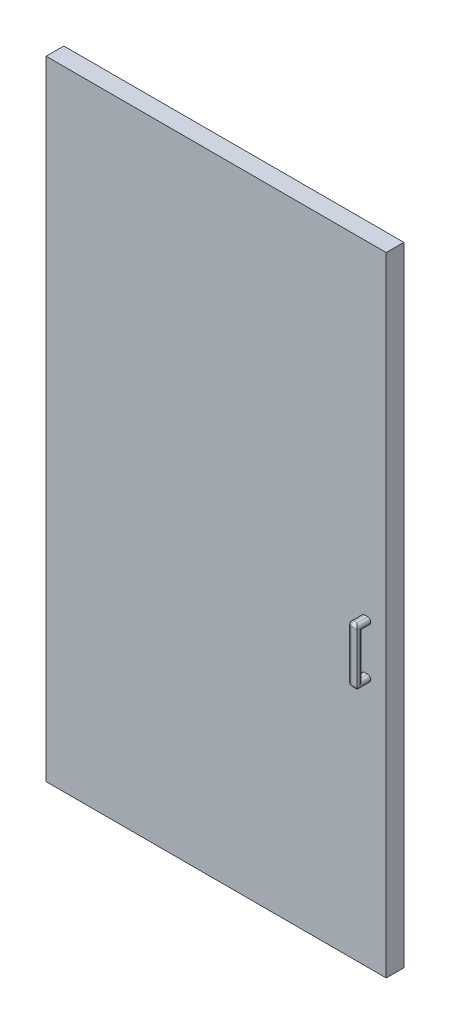
ISO-10303-21;
HEADER;
FILE_DESCRIPTION(('STEP AP214'),'2;1');
FILE_NAME('part.step','',(''),(''),'','','');
FILE_SCHEMA(('AUTOMOTIVE_DESIGN { 1 0 10303 214 1 1 1 1 }'));
ENDSEC;
DATA;
#1=APPLICATION_CONTEXT('core data for automotive mechanical design processes');
#2=APPLICATION_PROTOCOL_DEFINITION('international standard','automotive_design',2000,#1);
#3=PRODUCT_CONTEXT('',#1,'mechanical');
#4=PRODUCT('Part','Part','',(#3));
#5=PRODUCT_RELATED_PRODUCT_CATEGORY('part','',(#4));
#6=PRODUCT_DEFINITION_FORMATION('','',#4);
#7=PRODUCT_DEFINITION_CONTEXT('part definition',#1,'design');
#8=PRODUCT_DEFINITION('design','',#6,#7);
#9=PRODUCT_DEFINITION_SHAPE('','',#8);
#10=(LENGTH_UNIT() NAMED_UNIT(*) SI_UNIT(.MILLI.,.METRE.));
#11=(NAMED_UNIT(*) PLANE_ANGLE_UNIT() SI_UNIT($,.RADIAN.));
#12=(NAMED_UNIT(*) SI_UNIT($,.STERADIAN.) SOLID_ANGLE_UNIT());
#13=UNCERTAINTY_MEASURE_WITH_UNIT(LENGTH_MEASURE(1.E-05),#10,'distance_accuracy_value','');
#14=(GEOMETRIC_REPRESENTATION_CONTEXT(3) GLOBAL_UNCERTAINTY_ASSIGNED_CONTEXT((#13)) GLOBAL_UNIT_ASSIGNED_CONTEXT((#10,
#11,#12)) REPRESENTATION_CONTEXT('',''));
#15=CARTESIAN_POINT('',(0.,0.,0.));
#16=DIRECTION('',(0.,0.,1.));
#17=DIRECTION('',(1.,0.,0.));
#18=AXIS2_PLACEMENT_3D('',#15,#16,#17);
#19=CARTESIAN_POINT('',(0.,0.,0.));
#20=DIRECTION('',(0.,0.,1.));
#21=DIRECTION('',(1.,0.,0.));
#22=AXIS2_PLACEMENT_3D('',#19,#20,#21);
#23=PLANE('',#22);
#24=DIRECTION('',(-1.,0.,0.));
#25=VECTOR('',#24,1.);
#26=CARTESIAN_POINT('',(0.,446.201837212028,0.));
#27=LINE('',#26,#25);
#28=CARTESIAN_POINT('',(0.,446.201837212028,0.));
#29=VERTEX_POINT('',#28);
#30=CARTESIAN_POINT('',(-1100.,446.201837212028,0.));
#31=VERTEX_POINT('',#30);
#32=EDGE_CURVE('E257',#29,#31,#27,.T.);
#33=ORIENTED_EDGE('',*,*,#32,.F.);
#34=DIRECTION('',(0.,1.,0.));
#35=VECTOR('',#34,1.);
#36=CARTESIAN_POINT('',(0.,0.,0.));
#37=LINE('',#36,#35);
#38=CARTESIAN_POINT('',(0.,-1585.79816278797,0.));
#39=VERTEX_POINT('',#38);
#40=EDGE_CURVE('E275',#39,#29,#37,.T.);
#41=ORIENTED_EDGE('',*,*,#40,.F.);
#42=DIRECTION('',(1.,0.,0.));
#43=VECTOR('',#42,1.);
#44=CARTESIAN_POINT('',(-1100.,-1585.79816278797,0.));
#45=LINE('',#44,#43);
#46=CARTESIAN_POINT('',(-1100.,-1585.79816278797,0.));
#47=VERTEX_POINT('',#46);
#48=EDGE_CURVE('E286',#47,#39,#45,.T.);
#49=ORIENTED_EDGE('',*,*,#48,.F.);
#50=DIRECTION('',(0.,-1.,0.));
#51=VECTOR('',#50,1.);
#52=CARTESIAN_POINT('',(-1100.,446.201837212028,0.));
#53=LINE('',#52,#51);
#54=EDGE_CURVE('E284',#31,#47,#53,.T.);
#55=ORIENTED_EDGE('',*,*,#54,.F.);
#56=EDGE_LOOP('',(#33,#41,#49,#55));
#57=FACE_BOUND('',#56,.T.);
#58=DIRECTION('',(0.,-1.,0.));
#59=VECTOR('',#58,1.);
#60=CARTESIAN_POINT('',(-34.9999999999999,-272.048700510207,0.));
#61=LINE('',#60,#59);
#62=CARTESIAN_POINT('',(-34.9999999999999,-272.048700510207,0.));
#63=VERTEX_POINT('',#62);
#64=CARTESIAN_POINT('',(-35.,-812.048700510207,0.));
#65=VERTEX_POINT('',#64);
#66=EDGE_CURVE('E233',#63,#65,#61,.T.);
#67=ORIENTED_EDGE('',*,*,#66,.F.);
#68=DIRECTION('',(1.,0.,0.));
#69=VECTOR('',#68,1.);
#70=CARTESIAN_POINT('',(-34.9999999999999,-272.048700510207,0.));
#71=LINE('',#70,#69);
#72=CARTESIAN_POINT('',(-165.,-272.048700510207,0.));
#73=VERTEX_POINT('',#72);
#74=EDGE_CURVE('E230',#73,#63,#71,.T.);
#75=ORIENTED_EDGE('',*,*,#74,.F.);
#76=DIRECTION('',(0.,1.,0.));
#77=VECTOR('',#76,1.);
#78=CARTESIAN_POINT('',(-165.,-272.048700510207,0.));
#79=LINE('',#78,#77);
#80=CARTESIAN_POINT('',(-165.,-812.048700510207,0.));
#81=VERTEX_POINT('',#80);
#82=EDGE_CURVE('E61',#81,#73,#79,.T.);
#83=ORIENTED_EDGE('',*,*,#82,.F.);
#84=DIRECTION('',(-1.,0.,0.));
#85=VECTOR('',#84,1.);
#86=CARTESIAN_POINT('',(-35.,-812.048700510207,0.));
#87=LINE('',#86,#85);
#88=EDGE_CURVE('E56',#65,#81,#87,.T.);
#89=ORIENTED_EDGE('',*,*,#88,.F.);
#90=EDGE_LOOP('',(#67,#75,#83,#89));
#91=FACE_BOUND('',#90,.T.);
#92=ADVANCED_FACE('F39',(#57,#91),#23,.F.);
#93=CARTESIAN_POINT('',(-79.9999999999999,-603.798162787972,101.15));
#94=DIRECTION('',(1.,0.,0.));
#95=DIRECTION('',(0.,1.,0.));
#96=AXIS2_PLACEMENT_3D('',#93,#94,#95);
#97=PLANE('',#96);
#98=DIRECTION('',(0.,-1.,0.));
#99=VECTOR('',#98,1.);
#100=CARTESIAN_POINT('',(-79.9999999999999,-603.798162787972,57.15));
#101=LINE('',#100,#99);
#102=CARTESIAN_POINT('',(-79.9999999999999,-774.798162787972,57.15));
#103=VERTEX_POINT('',#102);
#104=CARTESIAN_POINT('',(-79.9999999999999,-775.798162787972,57.15));
#105=VERTEX_POINT('',#104);
#106=EDGE_CURVE('E265',#103,#105,#101,.T.);
#107=ORIENTED_EDGE('',*,*,#106,.T.);
#108=DIRECTION('',(0.,0.,-1.));
#109=VECTOR('',#108,1.);
#110=CARTESIAN_POINT('',(-79.9999999999999,-775.798162787972,101.15));
#111=LINE('',#110,#109);
#112=CARTESIAN_POINT('',(-79.9999999999999,-775.798162787972,91.15));
#113=VERTEX_POINT('',#112);
#114=EDGE_CURVE('E328',#105,#113,#111,.F.);
#115=ORIENTED_EDGE('',*,*,#114,.T.);
#116=DIRECTION('',(0.,-1.,0.));
#117=VECTOR('',#116,1.);
#118=CARTESIAN_POINT('',(-79.9999999999999,-603.798162787972,91.15));
#119=LINE('',#118,#117);
#120=CARTESIAN_POINT('',(-79.9999999999999,-774.798162787972,91.15));
#121=VERTEX_POINT('',#120);
#122=EDGE_CURVE('E324',#113,#121,#119,.F.);
#123=ORIENTED_EDGE('',*,*,#122,.T.);
#124=DIRECTION('',(0.,0.,-1.));
#125=VECTOR('',#124,1.);
#126=CARTESIAN_POINT('',(-79.9999999999999,-774.798162787972,57.15));
#127=LINE('',#126,#125);
#128=EDGE_CURVE('E326',#121,#103,#127,.T.);
#129=ORIENTED_EDGE('',*,*,#128,.T.);
#130=EDGE_LOOP('',(#107,#115,#123,#129));
#131=FACE_BOUND('',#130,.T.);
#132=ADVANCED_FACE('F497',(#131),#97,.F.);
#133=CARTESIAN_POINT('',(-49.9999999999999,-603.798162787972,101.15));
#134=DIRECTION('',(-1.,0.,0.));
#135=DIRECTION('',(0.,-1.,0.));
#136=AXIS2_PLACEMENT_3D('',#133,#134,#135);
#137=PLANE('',#136);
#138=DIRECTION('',(0.,1.,0.));
#139=VECTOR('',#138,1.);
#140=CARTESIAN_POINT('',(-49.9999999999999,-603.798162787972,57.15));
#141=LINE('',#140,#139);
#142=CARTESIAN_POINT('',(-49.9999999999999,-614.798162787972,57.15));
#143=VERTEX_POINT('',#142);
#144=CARTESIAN_POINT('',(-49.9999999999999,-613.798162787972,57.15));
#145=VERTEX_POINT('',#144);
#146=EDGE_CURVE('E243',#143,#145,#141,.T.);
#147=ORIENTED_EDGE('',*,*,#146,.T.);
#148=DIRECTION('',(0.,0.,-1.));
#149=VECTOR('',#148,1.);
#150=CARTESIAN_POINT('',(-49.9999999999999,-613.798162787972,101.15));
#151=LINE('',#150,#149);
#152=CARTESIAN_POINT('',(-49.9999999999999,-613.798162787972,101.15));
#153=VERTEX_POINT('',#152);
#154=EDGE_CURVE('E343',#145,#153,#151,.F.);
#155=ORIENTED_EDGE('',*,*,#154,.T.);
#156=DIRECTION('',(0.,1.,0.));
#157=VECTOR('',#156,1.);
#158=CARTESIAN_POINT('',(-49.9999999999999,-603.798162787972,101.15));
#159=LINE('',#158,#157);
#160=CARTESIAN_POINT('',(-49.9999999999999,-775.798162787972,101.15));
#161=VERTEX_POINT('',#160);
#162=EDGE_CURVE('E254',#161,#153,#159,.T.);
#163=ORIENTED_EDGE('',*,*,#162,.F.);
#164=DIRECTION('',(0.,0.,-1.));
#165=VECTOR('',#164,1.);
#166=CARTESIAN_POINT('',(-49.9999999999999,-775.798162787972,101.15));
#167=LINE('',#166,#165);
#168=CARTESIAN_POINT('',(-49.9999999999999,-775.798162787972,57.15));
#169=VERTEX_POINT('',#168);
#170=EDGE_CURVE('E335',#161,#169,#167,.T.);
#171=ORIENTED_EDGE('',*,*,#170,.T.);
#172=CARTESIAN_POINT('',(-49.9999999999999,-774.798162787972,57.15));
#173=VERTEX_POINT('',#172);
#174=EDGE_CURVE('E259',#169,#173,#141,.T.);
#175=ORIENTED_EDGE('',*,*,#174,.T.);
#176=DIRECTION('',(0.,0.,-1.));
#177=VECTOR('',#176,1.);
#178=CARTESIAN_POINT('',(-49.9999999999999,-774.798162787972,83.15));
#179=LINE('',#178,#177);
#180=CARTESIAN_POINT('',(-49.9999999999999,-774.798162787972,93.15));
#181=VERTEX_POINT('',#180);
#182=EDGE_CURVE('E337',#173,#181,#179,.F.);
#183=ORIENTED_EDGE('',*,*,#182,.T.);
#184=DIRECTION('',(0.,-1.,0.));
#185=VECTOR('',#184,1.);
#186=CARTESIAN_POINT('',(-49.9999999999999,-624.798162787972,93.15));
#187=LINE('',#186,#185);
#188=CARTESIAN_POINT('',(-49.9999999999999,-614.798162787972,93.15));
#189=VERTEX_POINT('',#188);
#190=EDGE_CURVE('E339',#181,#189,#187,.F.);
#191=ORIENTED_EDGE('',*,*,#190,.T.);
#192=DIRECTION('',(0.,0.,1.));
#193=VECTOR('',#192,1.);
#194=CARTESIAN_POINT('',(-49.9999999999999,-614.798162787972,57.15));
#195=LINE('',#194,#193);
#196=EDGE_CURVE('E341',#189,#143,#195,.F.);
#197=ORIENTED_EDGE('',*,*,#196,.T.);
#198=EDGE_LOOP('',(#147,#155,#163,#171,#175,#183,#191,#197));
#199=FACE_BOUND('',#198,.T.);
#200=ADVANCED_FACE('F417',(#199),#137,.F.);
#201=DIRECTION('',(0.,-1.,0.));
#202=VECTOR('',#201,1.);
#203=CARTESIAN_POINT('',(-79.9999999999999,-603.798162787972,91.15));
#204=LINE('',#203,#202);
#205=CARTESIAN_POINT('',(-79.9999999999999,-614.798162787972,91.15));
#206=VERTEX_POINT('',#205);
#207=CARTESIAN_POINT('',(-79.9999999999999,-613.798162787972,91.15));
#208=VERTEX_POINT('',#207);
#209=EDGE_CURVE('E318',#206,#208,#204,.F.);
#210=ORIENTED_EDGE('',*,*,#209,.T.);
#211=DIRECTION('',(0.,0.,-1.));
#212=VECTOR('',#211,1.);
#213=CARTESIAN_POINT('',(-79.9999999999999,-613.798162787972,101.15));
#214=LINE('',#213,#212);
#215=CARTESIAN_POINT('',(-79.9999999999999,-613.798162787972,57.15));
#216=VERTEX_POINT('',#215);
#217=EDGE_CURVE('E322',#208,#216,#214,.T.);
#218=ORIENTED_EDGE('',*,*,#217,.T.);
#219=CARTESIAN_POINT('',(-79.9999999999999,-614.798162787972,57.15));
#220=VERTEX_POINT('',#219);
#221=EDGE_CURVE('E266',#216,#220,#101,.T.);
#222=ORIENTED_EDGE('',*,*,#221,.T.);
#223=DIRECTION('',(0.,0.,1.));
#224=VECTOR('',#223,1.);
#225=CARTESIAN_POINT('',(-79.9999999999999,-614.798162787972,83.15));
#226=LINE('',#225,#224);
#227=EDGE_CURVE('E320',#220,#206,#226,.T.);
#228=ORIENTED_EDGE('',*,*,#227,.T.);
#229=EDGE_LOOP('',(#210,#218,#222,#228));
#230=FACE_BOUND('',#229,.T.);
#231=ADVANCED_FACE('F503',(#230),#97,.F.);
#232=CARTESIAN_POINT('',(0.,0.,57.15));
#233=DIRECTION('',(0.,0.,1.));
#234=DIRECTION('',(1.,0.,0.));
#235=AXIS2_PLACEMENT_3D('',#232,#233,#234);
#236=PLANE('',#235);
#237=DIRECTION('',(-1.,0.,0.));
#238=VECTOR('',#237,1.);
#239=CARTESIAN_POINT('',(-35.9999999999999,-764.798162787972,57.15));
#240=LINE('',#239,#238);
#241=CARTESIAN_POINT('',(-59.9999999999999,-764.798162787972,57.15));
#242=VERTEX_POINT('',#241);
#243=CARTESIAN_POINT('',(-69.9999999999999,-764.798162787972,57.15));
#244=VERTEX_POINT('',#243);
#245=EDGE_CURVE('E240',#242,#244,#240,.T.);
#246=ORIENTED_EDGE('',*,*,#245,.F.);
#247=CARTESIAN_POINT('',(-59.9999999999999,-774.798162787972,57.15));
#248=DIRECTION('',(0.,0.,1.));
#249=DIRECTION('',(1.,0.,0.));
#250=AXIS2_PLACEMENT_3D('',#247,#248,#249);
#251=CIRCLE('',#250,10.);
#252=EDGE_CURVE('E363',#242,#173,#251,.F.);
#253=ORIENTED_EDGE('',*,*,#252,.T.);
#254=ORIENTED_EDGE('',*,*,#174,.F.);
#255=CARTESIAN_POINT('',(-59.9999999999999,-775.798162787972,57.15));
#256=DIRECTION('',(0.,0.,1.));
#257=DIRECTION('',(1.,0.,0.));
#258=AXIS2_PLACEMENT_3D('',#255,#256,#257);
#259=CIRCLE('',#258,10.);
#260=CARTESIAN_POINT('',(-59.9999999999999,-785.798162787972,57.15));
#261=VERTEX_POINT('',#260);
#262=EDGE_CURVE('E365',#169,#261,#259,.F.);
#263=ORIENTED_EDGE('',*,*,#262,.T.);
#264=DIRECTION('',(1.,0.,0.));
#265=VECTOR('',#264,1.);
#266=CARTESIAN_POINT('',(-79.9999999999999,-785.798162787972,57.15));
#267=LINE('',#266,#265);
#268=CARTESIAN_POINT('',(-69.9999999999999,-785.798162787972,57.15));
#269=VERTEX_POINT('',#268);
#270=EDGE_CURVE('E258',#269,#261,#267,.T.);
#271=ORIENTED_EDGE('',*,*,#270,.F.);
#272=CARTESIAN_POINT('',(-69.9999999999999,-775.798162787972,57.15));
#273=DIRECTION('',(0.,0.,1.));
#274=DIRECTION('',(1.,0.,0.));
#275=AXIS2_PLACEMENT_3D('',#272,#273,#274);
#276=CIRCLE('',#275,10.);
#277=EDGE_CURVE('E48',#269,#105,#276,.F.);
#278=ORIENTED_EDGE('',*,*,#277,.T.);
#279=ORIENTED_EDGE('',*,*,#106,.F.);
#280=CARTESIAN_POINT('',(-69.9999999999999,-774.798162787972,57.15));
#281=DIRECTION('',(0.,0.,1.));
#282=DIRECTION('',(1.,0.,0.));
#283=AXIS2_PLACEMENT_3D('',#280,#281,#282);
#284=CIRCLE('',#283,10.);
#285=EDGE_CURVE('E11',#103,#244,#284,.F.);
#286=ORIENTED_EDGE('',*,*,#285,.T.);
#287=EDGE_LOOP('',(#246,#253,#254,#263,#271,#278,#279,#286));
#288=FACE_BOUND('',#287,.T.);
#289=ORIENTED_EDGE('',*,*,#146,.F.);
#290=CARTESIAN_POINT('',(-59.9999999999999,-614.798162787972,57.15));
#291=DIRECTION('',(0.,0.,1.));
#292=DIRECTION('',(1.,0.,0.));
#293=AXIS2_PLACEMENT_3D('',#290,#291,#292);
#294=CIRCLE('',#293,10.);
#295=CARTESIAN_POINT('',(-59.9999999999999,-624.798162787972,57.15));
#296=VERTEX_POINT('',#295);
#297=EDGE_CURVE('E361',#143,#296,#294,.F.);
#298=ORIENTED_EDGE('',*,*,#297,.T.);
#299=DIRECTION('',(-1.,0.,0.));
#300=VECTOR('',#299,1.);
#301=CARTESIAN_POINT('',(-35.9999999999999,-624.798162787972,57.15));
#302=LINE('',#301,#300);
#303=CARTESIAN_POINT('',(-69.9999999999999,-624.798162787972,57.15));
#304=VERTEX_POINT('',#303);
#305=EDGE_CURVE('E244',#296,#304,#302,.T.);
#306=ORIENTED_EDGE('',*,*,#305,.T.);
#307=CARTESIAN_POINT('',(-69.9999999999999,-614.798162787972,57.15));
#308=DIRECTION('',(0.,0.,1.));
#309=DIRECTION('',(1.,0.,0.));
#310=AXIS2_PLACEMENT_3D('',#307,#308,#309);
#311=CIRCLE('',#310,10.);
#312=EDGE_CURVE('E357',#304,#220,#311,.F.);
#313=ORIENTED_EDGE('',*,*,#312,.T.);
#314=ORIENTED_EDGE('',*,*,#221,.F.);
#315=CARTESIAN_POINT('',(-69.9999999999999,-613.798162787972,57.15));
#316=DIRECTION('',(0.,0.,1.));
#317=DIRECTION('',(1.,0.,0.));
#318=AXIS2_PLACEMENT_3D('',#315,#316,#317);
#319=CIRCLE('',#318,10.);
#320=CARTESIAN_POINT('',(-69.9999999999999,-603.798162787972,57.15));
#321=VERTEX_POINT('',#320);
#322=EDGE_CURVE('E355',#216,#321,#319,.F.);
#323=ORIENTED_EDGE('',*,*,#322,.T.);
#324=DIRECTION('',(-1.,0.,0.));
#325=VECTOR('',#324,1.);
#326=CARTESIAN_POINT('',(-79.9999999999999,-603.798162787972,57.15));
#327=LINE('',#326,#325);
#328=CARTESIAN_POINT('',(-59.9999999999999,-603.798162787972,57.15));
#329=VERTEX_POINT('',#328);
#330=EDGE_CURVE('E262',#329,#321,#327,.T.);
#331=ORIENTED_EDGE('',*,*,#330,.F.);
#332=CARTESIAN_POINT('',(-59.9999999999999,-613.798162787972,57.15));
#333=DIRECTION('',(0.,0.,1.));
#334=DIRECTION('',(1.,0.,0.));
#335=AXIS2_PLACEMENT_3D('',#332,#333,#334);
#336=CIRCLE('',#335,10.);
#337=EDGE_CURVE('E359',#329,#145,#336,.F.);
#338=ORIENTED_EDGE('',*,*,#337,.T.);
#339=EDGE_LOOP('',(#289,#298,#306,#313,#314,#323,#331,#338));
#340=FACE_BOUND('',#339,.T.);
#341=DIRECTION('',(-1.,0.,0.));
#342=VECTOR('',#341,1.);
#343=CARTESIAN_POINT('',(0.,446.201837212028,57.15));
#344=LINE('',#343,#342);
#345=CARTESIAN_POINT('',(0.,446.201837212028,57.15));
#346=VERTEX_POINT('',#345);
#347=CARTESIAN_POINT('',(-1100.,446.201837212028,57.15));
#348=VERTEX_POINT('',#347);
#349=EDGE_CURVE('E271',#346,#348,#344,.T.);
#350=ORIENTED_EDGE('',*,*,#349,.T.);
#351=DIRECTION('',(0.,-1.,0.));
#352=VECTOR('',#351,1.);
#353=CARTESIAN_POINT('',(-1100.,446.201837212028,57.15));
#354=LINE('',#353,#352);
#355=CARTESIAN_POINT('',(-1100.,-1585.79816278797,57.15));
#356=VERTEX_POINT('',#355);
#357=EDGE_CURVE('E274',#348,#356,#354,.T.);
#358=ORIENTED_EDGE('',*,*,#357,.T.);
#359=DIRECTION('',(1.,0.,0.));
#360=VECTOR('',#359,1.);
#361=CARTESIAN_POINT('',(-1100.,-1585.79816278797,57.15));
#362=LINE('',#361,#360);
#363=CARTESIAN_POINT('',(0.,-1585.79816278797,57.15));
#364=VERTEX_POINT('',#363);
#365=EDGE_CURVE('E277',#356,#364,#362,.T.);
#366=ORIENTED_EDGE('',*,*,#365,.T.);
#367=DIRECTION('',(0.,1.,0.));
#368=VECTOR('',#367,1.);
#369=CARTESIAN_POINT('',(0.,-1585.79816278797,57.15));
#370=LINE('',#369,#368);
#371=EDGE_CURVE('E279',#364,#346,#370,.T.);
#372=ORIENTED_EDGE('',*,*,#371,.T.);
#373=EDGE_LOOP('',(#350,#358,#366,#372));
#374=FACE_BOUND('',#373,.T.);
#375=ADVANCED_FACE('F421',(#288,#340,#374),#236,.T.);
#376=CARTESIAN_POINT('',(0.,446.201837212028,57.15));
#377=DIRECTION('',(0.,-1.,0.));
#378=DIRECTION('',(1.,0.,0.));
#379=AXIS2_PLACEMENT_3D('',#376,#377,#378);
#380=PLANE('',#379);
#381=ORIENTED_EDGE('',*,*,#32,.T.);
#382=DIRECTION('',(0.,0.,-1.));
#383=VECTOR('',#382,1.);
#384=CARTESIAN_POINT('',(-1100.,446.201837212028,57.15));
#385=LINE('',#384,#383);
#386=EDGE_CURVE('E298',#348,#31,#385,.T.);
#387=ORIENTED_EDGE('',*,*,#386,.F.);
#388=ORIENTED_EDGE('',*,*,#349,.F.);
#389=DIRECTION('',(0.,0.,-1.));
#390=VECTOR('',#389,1.);
#391=CARTESIAN_POINT('',(0.,446.201837212028,57.15));
#392=LINE('',#391,#390);
#393=EDGE_CURVE('E281',#346,#29,#392,.T.);
#394=ORIENTED_EDGE('',*,*,#393,.T.);
#395=EDGE_LOOP('',(#381,#387,#388,#394));
#396=FACE_BOUND('',#395,.T.);
#397=ADVANCED_FACE('F544',(#396),#380,.F.);
#398=CARTESIAN_POINT('',(-1100.,446.201837212028,57.15));
#399=DIRECTION('',(1.,0.,0.));
#400=DIRECTION('',(0.,0.,-1.));
#401=AXIS2_PLACEMENT_3D('',#398,#399,#400);
#402=PLANE('',#401);
#403=ORIENTED_EDGE('',*,*,#54,.T.);
#404=DIRECTION('',(0.,0.,-1.));
#405=VECTOR('',#404,1.);
#406=CARTESIAN_POINT('',(-1100.,-1585.79816278797,57.15));
#407=LINE('',#406,#405);
#408=EDGE_CURVE('E295',#356,#47,#407,.T.);
#409=ORIENTED_EDGE('',*,*,#408,.F.);
#410=ORIENTED_EDGE('',*,*,#357,.F.);
#411=ORIENTED_EDGE('',*,*,#386,.T.);
#412=EDGE_LOOP('',(#403,#409,#410,#411));
#413=FACE_BOUND('',#412,.T.);
#414=ADVANCED_FACE('F540',(#413),#402,.F.);
#415=CARTESIAN_POINT('',(-1100.,-1585.79816278797,57.15));
#416=DIRECTION('',(0.,1.,0.));
#417=DIRECTION('',(0.,0.,1.));
#418=AXIS2_PLACEMENT_3D('',#415,#416,#417);
#419=PLANE('',#418);
#420=ORIENTED_EDGE('',*,*,#48,.T.);
#421=DIRECTION('',(0.,0.,-1.));
#422=VECTOR('',#421,1.);
#423=CARTESIAN_POINT('',(0.,-1585.79816278797,57.15));
#424=LINE('',#423,#422);
#425=EDGE_CURVE('E292',#364,#39,#424,.T.);
#426=ORIENTED_EDGE('',*,*,#425,.F.);
#427=ORIENTED_EDGE('',*,*,#365,.F.);
#428=ORIENTED_EDGE('',*,*,#408,.T.);
#429=EDGE_LOOP('',(#420,#426,#427,#428));
#430=FACE_BOUND('',#429,.T.);
#431=ADVANCED_FACE('F536',(#430),#419,.F.);
#432=CARTESIAN_POINT('',(0.,0.,57.15));
#433=DIRECTION('',(-1.,0.,0.));
#434=DIRECTION('',(0.,0.,1.));
#435=AXIS2_PLACEMENT_3D('',#432,#433,#434);
#436=PLANE('',#435);
#437=ORIENTED_EDGE('',*,*,#40,.T.);
#438=ORIENTED_EDGE('',*,*,#393,.F.);
#439=ORIENTED_EDGE('',*,*,#371,.F.);
#440=ORIENTED_EDGE('',*,*,#425,.T.);
#441=EDGE_LOOP('',(#437,#438,#439,#440));
#442=FACE_BOUND('',#441,.T.);
#443=ADVANCED_FACE('F533',(#442),#436,.F.);
#444=CARTESIAN_POINT('',(-79.9999999999999,-603.798162787972,101.15));
#445=DIRECTION('',(0.,-1.,0.));
#446=DIRECTION('',(0.,0.,-1.));
#447=AXIS2_PLACEMENT_3D('',#444,#445,#446);
#448=PLANE('',#447);
#449=ORIENTED_EDGE('',*,*,#330,.T.);
#450=DIRECTION('',(0.,0.,-1.));
#451=VECTOR('',#450,1.);
#452=CARTESIAN_POINT('',(-69.9999999999999,-603.798162787972,101.15));
#453=LINE('',#452,#451);
#454=CARTESIAN_POINT('',(-69.9999999999999,-603.798162787972,91.15));
#455=VERTEX_POINT('',#454);
#456=EDGE_CURVE('E312',#321,#455,#453,.F.);
#457=ORIENTED_EDGE('',*,*,#456,.T.);
#458=DIRECTION('',(-1.,0.,0.));
#459=VECTOR('',#458,1.);
#460=CARTESIAN_POINT('',(-49.9999999999999,-603.798162787972,91.15));
#461=LINE('',#460,#459);
#462=CARTESIAN_POINT('',(-59.9999999999999,-603.798162787972,91.15));
#463=VERTEX_POINT('',#462);
#464=EDGE_CURVE('E310',#455,#463,#461,.F.);
#465=ORIENTED_EDGE('',*,*,#464,.T.);
#466=DIRECTION('',(0.,0.,-1.));
#467=VECTOR('',#466,1.);
#468=CARTESIAN_POINT('',(-59.9999999999999,-603.798162787972,101.15));
#469=LINE('',#468,#467);
#470=EDGE_CURVE('E308',#463,#329,#469,.T.);
#471=ORIENTED_EDGE('',*,*,#470,.T.);
#472=EDGE_LOOP('',(#449,#457,#465,#471));
#473=FACE_BOUND('',#472,.T.);
#474=ADVANCED_FACE('F511',(#473),#448,.F.);
#475=CARTESIAN_POINT('',(-79.9999999999999,-785.798162787972,101.15));
#476=DIRECTION('',(0.,1.,0.));
#477=DIRECTION('',(0.,0.,1.));
#478=AXIS2_PLACEMENT_3D('',#475,#476,#477);
#479=PLANE('',#478);
#480=ORIENTED_EDGE('',*,*,#270,.T.);
#481=DIRECTION('',(0.,0.,-1.));
#482=VECTOR('',#481,1.);
#483=CARTESIAN_POINT('',(-59.9999999999999,-785.798162787972,101.15));
#484=LINE('',#483,#482);
#485=CARTESIAN_POINT('',(-59.9999999999999,-785.798162787972,91.15));
#486=VERTEX_POINT('',#485);
#487=EDGE_CURVE('E353',#261,#486,#484,.F.);
#488=ORIENTED_EDGE('',*,*,#487,.T.);
#489=DIRECTION('',(1.,0.,0.));
#490=VECTOR('',#489,1.);
#491=CARTESIAN_POINT('',(-79.9999999999999,-785.798162787972,91.15));
#492=LINE('',#491,#490);
#493=CARTESIAN_POINT('',(-69.9999999999999,-785.798162787972,91.15));
#494=VERTEX_POINT('',#493);
#495=EDGE_CURVE('E349',#486,#494,#492,.F.);
#496=ORIENTED_EDGE('',*,*,#495,.T.);
#497=DIRECTION('',(0.,0.,-1.));
#498=VECTOR('',#497,1.);
#499=CARTESIAN_POINT('',(-69.9999999999999,-785.798162787972,101.15));
#500=LINE('',#499,#498);
#501=EDGE_CURVE('E351',#494,#269,#500,.T.);
#502=ORIENTED_EDGE('',*,*,#501,.T.);
#503=EDGE_LOOP('',(#480,#488,#496,#502));
#504=FACE_BOUND('',#503,.T.);
#505=ADVANCED_FACE('F492',(#504),#479,.F.);
#506=CARTESIAN_POINT('',(0.,0.,101.15));
#507=DIRECTION('',(0.,0.,1.));
#508=DIRECTION('',(1.,0.,0.));
#509=AXIS2_PLACEMENT_3D('',#506,#507,#508);
#510=PLANE('',#509);
#511=ORIENTED_EDGE('',*,*,#162,.T.);
#512=DIRECTION('',(-1.,0.,0.));
#513=VECTOR('',#512,1.);
#514=CARTESIAN_POINT('',(-79.9999999999999,-613.798162787972,101.15));
#515=LINE('',#514,#513);
#516=CARTESIAN_POINT('',(-69.9999999999999,-613.798162787972,101.15));
#517=VERTEX_POINT('',#516);
#518=EDGE_CURVE('E305',#153,#517,#515,.T.);
#519=ORIENTED_EDGE('',*,*,#518,.T.);
#520=DIRECTION('',(0.,-1.,0.));
#521=VECTOR('',#520,1.);
#522=CARTESIAN_POINT('',(-69.9999999999999,-785.798162787972,101.15));
#523=LINE('',#522,#521);
#524=CARTESIAN_POINT('',(-69.9999999999999,-775.798162787972,101.15));
#525=VERTEX_POINT('',#524);
#526=EDGE_CURVE('E303',#517,#525,#523,.T.);
#527=ORIENTED_EDGE('',*,*,#526,.T.);
#528=DIRECTION('',(1.,0.,0.));
#529=VECTOR('',#528,1.);
#530=CARTESIAN_POINT('',(-49.9999999999999,-775.798162787972,101.15));
#531=LINE('',#530,#529);
#532=EDGE_CURVE('E301',#525,#161,#531,.T.);
#533=ORIENTED_EDGE('',*,*,#532,.T.);
#534=EDGE_LOOP('',(#511,#519,#527,#533));
#535=FACE_BOUND('',#534,.T.);
#536=ADVANCED_FACE('F475',(#535),#510,.T.);
#537=CARTESIAN_POINT('',(-35.9999999999999,-764.798162787972,0.));
#538=DIRECTION('',(0.,1.,0.));
#539=DIRECTION('',(-1.,0.,0.));
#540=AXIS2_PLACEMENT_3D('',#537,#538,#539);
#541=PLANE('',#540);
#542=DIRECTION('',(-1.,0.,0.));
#543=VECTOR('',#542,1.);
#544=CARTESIAN_POINT('',(-35.9999999999999,-764.798162787972,83.15));
#545=LINE('',#544,#543);
#546=CARTESIAN_POINT('',(-59.9999999999999,-764.798162787972,83.15));
#547=VERTEX_POINT('',#546);
#548=CARTESIAN_POINT('',(-69.9999999999999,-764.798162787972,83.15));
#549=VERTEX_POINT('',#548);
#550=EDGE_CURVE('E250',#547,#549,#545,.T.);
#551=ORIENTED_EDGE('',*,*,#550,.F.);
#552=DIRECTION('',(0.,0.,-1.));
#553=VECTOR('',#552,1.);
#554=CARTESIAN_POINT('',(-59.9999999999999,-764.798162787972,57.15));
#555=LINE('',#554,#553);
#556=EDGE_CURVE('E347',#547,#242,#555,.T.);
#557=ORIENTED_EDGE('',*,*,#556,.T.);
#558=ORIENTED_EDGE('',*,*,#245,.T.);
#559=DIRECTION('',(0.,0.,-1.));
#560=VECTOR('',#559,1.);
#561=CARTESIAN_POINT('',(-69.9999999999999,-764.798162787972,83.15));
#562=LINE('',#561,#560);
#563=EDGE_CURVE('E345',#244,#549,#562,.F.);
#564=ORIENTED_EDGE('',*,*,#563,.T.);
#565=EDGE_LOOP('',(#551,#557,#558,#564));
#566=FACE_BOUND('',#565,.T.);
#567=ADVANCED_FACE('F575',(#566),#541,.T.);
#568=CARTESIAN_POINT('',(-35.9999999999999,-624.798162787972,0.));
#569=DIRECTION('',(0.,-1.,0.));
#570=DIRECTION('',(1.,0.,0.));
#571=AXIS2_PLACEMENT_3D('',#568,#569,#570);
#572=PLANE('',#571);
#573=DIRECTION('',(-1.,0.,0.));
#574=VECTOR('',#573,1.);
#575=CARTESIAN_POINT('',(-35.9999999999999,-624.798162787972,83.15));
#576=LINE('',#575,#574);
#577=CARTESIAN_POINT('',(-59.9999999999999,-624.798162787972,83.15));
#578=VERTEX_POINT('',#577);
#579=CARTESIAN_POINT('',(-69.9999999999999,-624.798162787972,83.15));
#580=VERTEX_POINT('',#579);
#581=EDGE_CURVE('E247',#578,#580,#576,.T.);
#582=ORIENTED_EDGE('',*,*,#581,.T.);
#583=DIRECTION('',(0.,0.,1.));
#584=VECTOR('',#583,1.);
#585=CARTESIAN_POINT('',(-69.9999999999999,-624.798162787972,57.15));
#586=LINE('',#585,#584);
#587=EDGE_CURVE('E333',#580,#304,#586,.F.);
#588=ORIENTED_EDGE('',*,*,#587,.T.);
#589=ORIENTED_EDGE('',*,*,#305,.F.);
#590=DIRECTION('',(0.,0.,1.));
#591=VECTOR('',#590,1.);
#592=CARTESIAN_POINT('',(-59.9999999999999,-624.798162787972,83.15));
#593=LINE('',#592,#591);
#594=EDGE_CURVE('E330',#296,#578,#593,.T.);
#595=ORIENTED_EDGE('',*,*,#594,.T.);
#596=EDGE_LOOP('',(#582,#588,#589,#595));
#597=FACE_BOUND('',#596,.T.);
#598=ADVANCED_FACE('F445',(#597),#572,.T.);
#599=CARTESIAN_POINT('',(-36.0000000000001,0.,83.1499999999999));
#600=DIRECTION('',(0.,0.,-1.));
#601=DIRECTION('',(0.,1.,0.));
#602=AXIS2_PLACEMENT_3D('',#599,#600,#601);
#603=PLANE('',#602);
#604=ORIENTED_EDGE('',*,*,#550,.T.);
#605=DIRECTION('',(0.,-1.,0.));
#606=VECTOR('',#605,1.);
#607=CARTESIAN_POINT('',(-69.9999999999999,-624.798162787972,83.15));
#608=LINE('',#607,#606);
#609=EDGE_CURVE('E316',#549,#580,#608,.F.);
#610=ORIENTED_EDGE('',*,*,#609,.T.);
#611=ORIENTED_EDGE('',*,*,#581,.F.);
#612=DIRECTION('',(0.,-1.,0.));
#613=VECTOR('',#612,1.);
#614=CARTESIAN_POINT('',(-59.9999999999999,-764.798162787972,83.15));
#615=LINE('',#614,#613);
#616=EDGE_CURVE('E314',#578,#547,#615,.T.);
#617=ORIENTED_EDGE('',*,*,#616,.T.);
#618=EDGE_LOOP('',(#604,#610,#611,#617));
#619=FACE_BOUND('',#618,.T.);
#620=ADVANCED_FACE('F447',(#619),#603,.T.);
#621=CARTESIAN_POINT('',(-59.9999999999999,-775.798162787972,101.15));
#622=DIRECTION('',(0.,0.,-1.));
#623=DIRECTION('',(-1.,0.,0.));
#624=AXIS2_PLACEMENT_3D('',#621,#622,#623);
#625=CYLINDRICAL_SURFACE('',#624,10.);
#626=ORIENTED_EDGE('',*,*,#262,.F.);
#627=ORIENTED_EDGE('',*,*,#170,.F.);
#628=CARTESIAN_POINT('',(-59.9999999999999,-775.798162787972,91.15));
#629=DIRECTION('',(-0.707106781186547,0.,0.707106781186547));
#630=DIRECTION('',(-0.707106781186547,0.,-0.707106781186547));
#631=AXIS2_PLACEMENT_3D('',#628,#629,#630);
#632=ELLIPSE('',#631,14.1421356237309,10.);
#633=EDGE_CURVE('E253',#486,#161,#632,.T.);
#634=ORIENTED_EDGE('',*,*,#633,.F.);
#635=ORIENTED_EDGE('',*,*,#487,.F.);
#636=EDGE_LOOP('',(#626,#627,#634,#635));
#637=FACE_BOUND('',#636,.T.);
#638=ADVANCED_FACE('F412',(#637),#625,.T.);
#639=CARTESIAN_POINT('',(0.,-775.798162787972,91.15));
#640=DIRECTION('',(-1.,0.,0.));
#641=DIRECTION('',(0.,0.,1.));
#642=AXIS2_PLACEMENT_3D('',#639,#640,#641);
#643=CYLINDRICAL_SURFACE('',#642,10.);
#644=ORIENTED_EDGE('',*,*,#633,.T.);
#645=ORIENTED_EDGE('',*,*,#532,.F.);
#646=CARTESIAN_POINT('',(-69.9999999999999,-775.798162787972,91.15));
#647=DIRECTION('',(-1.,0.,0.));
#648=DIRECTION('',(0.,0.,1.));
#649=AXIS2_PLACEMENT_3D('',#646,#647,#648);
#650=CIRCLE('',#649,10.);
#651=EDGE_CURVE('E398',#494,#525,#650,.T.);
#652=ORIENTED_EDGE('',*,*,#651,.F.);
#653=ORIENTED_EDGE('',*,*,#495,.F.);
#654=EDGE_LOOP('',(#644,#645,#652,#653));
#655=FACE_BOUND('',#654,.T.);
#656=ADVANCED_FACE('F406',(#655),#643,.T.);
#657=CARTESIAN_POINT('',(-69.9999999999999,-775.798162787972,101.15));
#658=DIRECTION('',(0.,0.,-1.));
#659=DIRECTION('',(-1.,0.,0.));
#660=AXIS2_PLACEMENT_3D('',#657,#658,#659);
#661=CYLINDRICAL_SURFACE('',#660,10.);
#662=ORIENTED_EDGE('',*,*,#277,.F.);
#663=ORIENTED_EDGE('',*,*,#501,.F.);
#664=CARTESIAN_POINT('',(-69.9999999999999,-775.798162787972,91.15));
#665=DIRECTION('',(0.,0.,1.));
#666=DIRECTION('',(1.,0.,0.));
#667=AXIS2_PLACEMENT_3D('',#664,#665,#666);
#668=CIRCLE('',#667,10.);
#669=EDGE_CURVE('E395',#113,#494,#668,.T.);
#670=ORIENTED_EDGE('',*,*,#669,.F.);
#671=ORIENTED_EDGE('',*,*,#114,.F.);
#672=EDGE_LOOP('',(#662,#663,#670,#671));
#673=FACE_BOUND('',#672,.T.);
#674=ADVANCED_FACE('F490',(#673),#661,.T.);
#675=CARTESIAN_POINT('',(-69.9999999999999,-775.798162787972,91.15));
#676=DIRECTION('',(0.,-1.,0.));
#677=DIRECTION('',(0.,0.,-1.));
#678=AXIS2_PLACEMENT_3D('',#675,#676,#677);
#679=SPHERICAL_SURFACE('',#678,10.);
#680=ORIENTED_EDGE('',*,*,#669,.T.);
#681=ORIENTED_EDGE('',*,*,#651,.T.);
#682=CARTESIAN_POINT('',(-69.9999999999999,-775.798162787972,91.15));
#683=DIRECTION('',(0.,-1.,0.));
#684=DIRECTION('',(0.,0.,-1.));
#685=AXIS2_PLACEMENT_3D('',#682,#683,#684);
#686=CIRCLE('',#685,10.);
#687=EDGE_CURVE('E388',#113,#525,#686,.F.);
#688=ORIENTED_EDGE('',*,*,#687,.F.);
#689=EDGE_LOOP('',(#680,#681,#688));
#690=FACE_BOUND('',#689,.T.);
#691=ADVANCED_FACE('F484',(#690),#679,.T.);
#692=CARTESIAN_POINT('',(-69.9999999999999,-774.798162787972,101.15));
#693=DIRECTION('',(0.,0.,1.));
#694=DIRECTION('',(1.,0.,0.));
#695=AXIS2_PLACEMENT_3D('',#692,#693,#694);
#696=CYLINDRICAL_SURFACE('',#695,10.);
#697=CARTESIAN_POINT('',(-69.9999999999999,-774.798162787972,93.15));
#698=DIRECTION('',(0.,0.707106781186548,0.707106781186547));
#699=DIRECTION('',(0.,0.707106781186547,-0.707106781186547));
#700=AXIS2_PLACEMENT_3D('',#697,#698,#699);
#701=ELLIPSE('',#700,14.142135623731,10.);
#702=CARTESIAN_POINT('',(-79.9498743710661,-773.798162787972,92.15));
#703=VERTEX_POINT('',#702);
#704=EDGE_CURVE('E393',#549,#703,#701,.T.);
#705=ORIENTED_EDGE('',*,*,#704,.F.);
#706=ORIENTED_EDGE('',*,*,#563,.F.);
#707=ORIENTED_EDGE('',*,*,#285,.F.);
#708=ORIENTED_EDGE('',*,*,#128,.F.);
#709=CARTESIAN_POINT('',(-69.9999999999999,-774.798162787972,91.15));
#710=DIRECTION('',(0.,-0.707106781186547,0.707106781186547));
#711=DIRECTION('',(0.,0.707106781186547,0.707106781186547));
#712=AXIS2_PLACEMENT_3D('',#709,#710,#711);
#713=ELLIPSE('',#712,14.1421356237309,10.);
#714=EDGE_CURVE('E385',#703,#121,#713,.T.);
#715=ORIENTED_EDGE('',*,*,#714,.F.);
#716=EDGE_LOOP('',(#705,#706,#707,#708,#715));
#717=FACE_BOUND('',#716,.T.);
#718=ADVANCED_FACE('F500',(#717),#696,.T.);
#719=CARTESIAN_POINT('',(-69.9999999999999,-603.798162787972,93.15));
#720=DIRECTION('',(0.,1.,0.));
#721=DIRECTION('',(-1.,0.,0.));
#722=AXIS2_PLACEMENT_3D('',#719,#720,#721);
#723=CYLINDRICAL_SURFACE('',#722,10.);
#724=CARTESIAN_POINT('',(-69.9999999999999,-614.798162787972,93.15));
#725=DIRECTION('',(0.,0.707106781186547,-0.707106781186547));
#726=DIRECTION('',(0.,0.707106781186548,0.707106781186547));
#727=AXIS2_PLACEMENT_3D('',#724,#725,#726);
#728=ELLIPSE('',#727,14.1421356237309,10.);
#729=CARTESIAN_POINT('',(-79.9498743710661,-615.798162787972,92.15));
#730=VERTEX_POINT('',#729);
#731=EDGE_CURVE('E391',#580,#730,#728,.T.);
#732=ORIENTED_EDGE('',*,*,#731,.F.);
#733=ORIENTED_EDGE('',*,*,#609,.F.);
#734=ORIENTED_EDGE('',*,*,#704,.T.);
#735=DIRECTION('',(0.,1.,0.));
#736=VECTOR('',#735,1.);
#737=CARTESIAN_POINT('',(-79.9498743710661,-694.798162787972,92.15));
#738=LINE('',#737,#736);
#739=EDGE_CURVE('E382',#730,#703,#738,.F.);
#740=ORIENTED_EDGE('',*,*,#739,.F.);
#741=EDGE_LOOP('',(#732,#733,#734,#740));
#742=FACE_BOUND('',#741,.T.);
#743=ADVANCED_FACE('F451',(#742),#723,.T.);
#744=CARTESIAN_POINT('',(-69.9999999999999,-614.798162787972,101.15));
#745=DIRECTION('',(0.,0.,-1.));
#746=DIRECTION('',(-1.,0.,0.));
#747=AXIS2_PLACEMENT_3D('',#744,#745,#746);
#748=CYLINDRICAL_SURFACE('',#747,10.);
#749=ORIENTED_EDGE('',*,*,#587,.F.);
#750=ORIENTED_EDGE('',*,*,#731,.T.);
#751=CARTESIAN_POINT('',(-69.9999999999999,-614.798162787972,91.15));
#752=DIRECTION('',(0.,-0.707106781186547,-0.707106781186547));
#753=DIRECTION('',(0.,0.707106781186547,-0.707106781186547));
#754=AXIS2_PLACEMENT_3D('',#751,#752,#753);
#755=ELLIPSE('',#754,14.1421356237309,10.);
#756=EDGE_CURVE('E379',#206,#730,#755,.F.);
#757=ORIENTED_EDGE('',*,*,#756,.F.);
#758=ORIENTED_EDGE('',*,*,#227,.F.);
#759=ORIENTED_EDGE('',*,*,#312,.F.);
#760=EDGE_LOOP('',(#749,#750,#757,#758,#759));
#761=FACE_BOUND('',#760,.T.);
#762=ADVANCED_FACE('F458',(#761),#748,.T.);
#763=CARTESIAN_POINT('',(-70.,0.,91.15));
#764=DIRECTION('',(0.,1.,0.));
#765=DIRECTION('',(-1.,0.,0.));
#766=AXIS2_PLACEMENT_3D('',#763,#764,#765);
#767=CYLINDRICAL_SURFACE('',#766,10.);
#768=ORIENTED_EDGE('',*,*,#687,.T.);
#769=ORIENTED_EDGE('',*,*,#526,.F.);
#770=CARTESIAN_POINT('',(-69.9999999999999,-613.798162787972,91.15));
#771=DIRECTION('',(0.,1.,0.));
#772=DIRECTION('',(0.,0.,1.));
#773=AXIS2_PLACEMENT_3D('',#770,#771,#772);
#774=CIRCLE('',#773,10.);
#775=EDGE_CURVE('E376',#208,#517,#774,.T.);
#776=ORIENTED_EDGE('',*,*,#775,.F.);
#777=ORIENTED_EDGE('',*,*,#209,.F.);
#778=ORIENTED_EDGE('',*,*,#756,.T.);
#779=ORIENTED_EDGE('',*,*,#739,.T.);
#780=ORIENTED_EDGE('',*,*,#714,.T.);
#781=ORIENTED_EDGE('',*,*,#122,.F.);
#782=EDGE_LOOP('',(#768,#769,#776,#777,#778,#779,#780,#781));
#783=FACE_BOUND('',#782,.T.);
#784=ADVANCED_FACE('F479',(#783),#767,.T.);
#785=CARTESIAN_POINT('',(-69.9999999999999,-613.798162787972,101.15));
#786=DIRECTION('',(0.,0.,-1.));
#787=DIRECTION('',(-1.,0.,0.));
#788=AXIS2_PLACEMENT_3D('',#785,#786,#787);
#789=CYLINDRICAL_SURFACE('',#788,10.);
#790=ORIENTED_EDGE('',*,*,#322,.F.);
#791=ORIENTED_EDGE('',*,*,#217,.F.);
#792=CARTESIAN_POINT('',(-69.9999999999999,-613.798162787972,91.15));
#793=DIRECTION('',(0.,0.,1.));
#794=DIRECTION('',(1.,0.,0.));
#795=AXIS2_PLACEMENT_3D('',#792,#793,#794);
#796=CIRCLE('',#795,10.);
#797=EDGE_CURVE('E373',#455,#208,#796,.T.);
#798=ORIENTED_EDGE('',*,*,#797,.F.);
#799=ORIENTED_EDGE('',*,*,#456,.F.);
#800=EDGE_LOOP('',(#790,#791,#798,#799));
#801=FACE_BOUND('',#800,.T.);
#802=ADVANCED_FACE('F508',(#801),#789,.T.);
#803=CARTESIAN_POINT('',(-59.9999999999999,-613.798162787972,101.15));
#804=DIRECTION('',(0.,0.,-1.));
#805=DIRECTION('',(-1.,0.,0.));
#806=AXIS2_PLACEMENT_3D('',#803,#804,#805);
#807=CYLINDRICAL_SURFACE('',#806,10.);
#808=ORIENTED_EDGE('',*,*,#337,.F.);
#809=ORIENTED_EDGE('',*,*,#470,.F.);
#810=CARTESIAN_POINT('',(-59.9999999999999,-613.798162787972,91.15));
#811=DIRECTION('',(0.707106781186547,0.,-0.707106781186547));
#812=DIRECTION('',(-0.707106781186547,0.,-0.707106781186547));
#813=AXIS2_PLACEMENT_3D('',#810,#811,#812);
#814=ELLIPSE('',#813,14.1421356237309,10.);
#815=EDGE_CURVE('E370',#153,#463,#814,.F.);
#816=ORIENTED_EDGE('',*,*,#815,.F.);
#817=ORIENTED_EDGE('',*,*,#154,.F.);
#818=EDGE_LOOP('',(#808,#809,#816,#817));
#819=FACE_BOUND('',#818,.T.);
#820=ADVANCED_FACE('F467',(#819),#807,.T.);
#821=CARTESIAN_POINT('',(-69.9999999999999,-613.798162787972,91.15));
#822=DIRECTION('',(-1.,0.,0.));
#823=DIRECTION('',(0.,0.,1.));
#824=AXIS2_PLACEMENT_3D('',#821,#822,#823);
#825=SPHERICAL_SURFACE('',#824,10.);
#826=ORIENTED_EDGE('',*,*,#797,.T.);
#827=ORIENTED_EDGE('',*,*,#775,.T.);
#828=CARTESIAN_POINT('',(-69.9999999999999,-613.798162787972,91.15));
#829=DIRECTION('',(-1.,0.,0.));
#830=DIRECTION('',(0.,0.,1.));
#831=AXIS2_PLACEMENT_3D('',#828,#829,#830);
#832=CIRCLE('',#831,10.);
#833=EDGE_CURVE('E368',#455,#517,#832,.F.);
#834=ORIENTED_EDGE('',*,*,#833,.F.);
#835=EDGE_LOOP('',(#826,#827,#834));
#836=FACE_BOUND('',#835,.T.);
#837=ADVANCED_FACE('F513',(#836),#825,.T.);
#838=CARTESIAN_POINT('',(0.,-613.798162787972,91.15));
#839=DIRECTION('',(1.,0.,0.));
#840=DIRECTION('',(0.,0.,-1.));
#841=AXIS2_PLACEMENT_3D('',#838,#839,#840);
#842=CYLINDRICAL_SURFACE('',#841,10.);
#843=ORIENTED_EDGE('',*,*,#815,.T.);
#844=ORIENTED_EDGE('',*,*,#464,.F.);
#845=ORIENTED_EDGE('',*,*,#833,.T.);
#846=ORIENTED_EDGE('',*,*,#518,.F.);
#847=EDGE_LOOP('',(#843,#844,#845,#846));
#848=FACE_BOUND('',#847,.T.);
#849=ADVANCED_FACE('F472',(#848),#842,.T.);
#850=CARTESIAN_POINT('',(-59.9999999999999,-774.798162787972,0.));
#851=DIRECTION('',(0.,0.,1.));
#852=DIRECTION('',(1.,0.,0.));
#853=AXIS2_PLACEMENT_3D('',#850,#851,#852);
#854=CYLINDRICAL_SURFACE('',#853,10.);
#855=ORIENTED_EDGE('',*,*,#252,.F.);
#856=ORIENTED_EDGE('',*,*,#556,.F.);
#857=CARTESIAN_POINT('',(-59.9999999999999,-774.798162787972,93.15));
#858=DIRECTION('',(0.,0.707106781186548,0.707106781186547));
#859=DIRECTION('',(0.,0.707106781186547,-0.707106781186547));
#860=AXIS2_PLACEMENT_3D('',#857,#858,#859);
#861=ELLIPSE('',#860,14.142135623731,10.);
#862=EDGE_CURVE('E43',#181,#547,#861,.T.);
#863=ORIENTED_EDGE('',*,*,#862,.F.);
#864=ORIENTED_EDGE('',*,*,#182,.F.);
#865=EDGE_LOOP('',(#855,#856,#863,#864));
#866=FACE_BOUND('',#865,.T.);
#867=ADVANCED_FACE('F41',(#866),#854,.T.);
#868=CARTESIAN_POINT('',(-60.,0.,93.1499999999999));
#869=DIRECTION('',(0.,1.,0.));
#870=DIRECTION('',(-1.,0.,0.));
#871=AXIS2_PLACEMENT_3D('',#868,#869,#870);
#872=CYLINDRICAL_SURFACE('',#871,10.);
#873=ORIENTED_EDGE('',*,*,#862,.T.);
#874=ORIENTED_EDGE('',*,*,#616,.F.);
#875=CARTESIAN_POINT('',(-59.9999999999999,-614.798162787972,93.15));
#876=DIRECTION('',(0.,0.707106781186547,-0.707106781186547));
#877=DIRECTION('',(0.,-0.707106781186548,-0.707106781186547));
#878=AXIS2_PLACEMENT_3D('',#875,#876,#877);
#879=ELLIPSE('',#878,14.1421356237309,10.);
#880=EDGE_CURVE('E234',#189,#578,#879,.T.);
#881=ORIENTED_EDGE('',*,*,#880,.F.);
#882=ORIENTED_EDGE('',*,*,#190,.F.);
#883=EDGE_LOOP('',(#873,#874,#881,#882));
#884=FACE_BOUND('',#883,.T.);
#885=ADVANCED_FACE('F439',(#884),#872,.T.);
#886=CARTESIAN_POINT('',(-59.9999999999999,-614.798162787972,0.));
#887=DIRECTION('',(0.,0.,-1.));
#888=DIRECTION('',(-1.,0.,0.));
#889=AXIS2_PLACEMENT_3D('',#886,#887,#888);
#890=CYLINDRICAL_SURFACE('',#889,10.);
#891=ORIENTED_EDGE('',*,*,#297,.F.);
#892=ORIENTED_EDGE('',*,*,#196,.F.);
#893=ORIENTED_EDGE('',*,*,#880,.T.);
#894=ORIENTED_EDGE('',*,*,#594,.F.);
#895=EDGE_LOOP('',(#891,#892,#893,#894));
#896=FACE_BOUND('',#895,.T.);
#897=ADVANCED_FACE('F436',(#896),#890,.T.);
#898=CARTESIAN_POINT('',(-34.9999999999999,-272.048700510207,-10.));
#899=DIRECTION('',(-1.,0.,0.));
#900=DIRECTION('',(0.,-1.,0.));
#901=AXIS2_PLACEMENT_3D('',#898,#899,#900);
#902=PLANE('',#901);
#903=ORIENTED_EDGE('',*,*,#66,.T.);
#904=DIRECTION('',(0.,0.,1.));
#905=VECTOR('',#904,1.);
#906=CARTESIAN_POINT('',(-35.,-812.048700510207,-10.));
#907=LINE('',#906,#905);
#908=CARTESIAN_POINT('',(-35.,-812.048700510207,-10.));
#909=VERTEX_POINT('',#908);
#910=EDGE_CURVE('E214',#909,#65,#907,.T.);
#911=ORIENTED_EDGE('',*,*,#910,.F.);
#912=DIRECTION('',(0.,-1.,0.));
#913=VECTOR('',#912,1.);
#914=CARTESIAN_POINT('',(-34.9999999999999,-272.048700510207,-10.));
#915=LINE('',#914,#913);
#916=CARTESIAN_POINT('',(-34.9999999999999,-272.048700510207,-10.));
#917=VERTEX_POINT('',#916);
#918=EDGE_CURVE('E221',#917,#909,#915,.T.);
#919=ORIENTED_EDGE('',*,*,#918,.F.);
#920=DIRECTION('',(0.,0.,1.));
#921=VECTOR('',#920,1.);
#922=CARTESIAN_POINT('',(-34.9999999999999,-272.048700510207,-10.));
#923=LINE('',#922,#921);
#924=EDGE_CURVE('E899',#917,#63,#923,.T.);
#925=ORIENTED_EDGE('',*,*,#924,.T.);
#926=EDGE_LOOP('',(#903,#911,#919,#925));
#927=FACE_BOUND('',#926,.T.);
#928=ADVANCED_FACE('F232',(#927),#902,.F.);
#929=CARTESIAN_POINT('',(-35.,-812.048700510207,-10.));
#930=DIRECTION('',(0.,1.,0.));
#931=DIRECTION('',(0.,0.,1.));
#932=AXIS2_PLACEMENT_3D('',#929,#930,#931);
#933=PLANE('',#932);
#934=ORIENTED_EDGE('',*,*,#88,.T.);
#935=DIRECTION('',(0.,0.,1.));
#936=VECTOR('',#935,1.);
#937=CARTESIAN_POINT('',(-165.,-812.048700510207,-10.));
#938=LINE('',#937,#936);
#939=CARTESIAN_POINT('',(-165.,-812.048700510207,-10.));
#940=VERTEX_POINT('',#939);
#941=EDGE_CURVE('E217',#940,#81,#938,.T.);
#942=ORIENTED_EDGE('',*,*,#941,.F.);
#943=DIRECTION('',(-1.,0.,0.));
#944=VECTOR('',#943,1.);
#945=CARTESIAN_POINT('',(-35.,-812.048700510207,-10.));
#946=LINE('',#945,#944);
#947=EDGE_CURVE('E210',#909,#940,#946,.T.);
#948=ORIENTED_EDGE('',*,*,#947,.F.);
#949=ORIENTED_EDGE('',*,*,#910,.T.);
#950=EDGE_LOOP('',(#934,#942,#948,#949));
#951=FACE_BOUND('',#950,.T.);
#952=ADVANCED_FACE('F212',(#951),#933,.F.);
#953=CARTESIAN_POINT('',(-165.,-272.048700510207,-10.));
#954=DIRECTION('',(1.,0.,0.));
#955=DIRECTION('',(0.,1.,0.));
#956=AXIS2_PLACEMENT_3D('',#953,#954,#955);
#957=PLANE('',#956);
#958=ORIENTED_EDGE('',*,*,#82,.T.);
#959=DIRECTION('',(0.,0.,1.));
#960=VECTOR('',#959,1.);
#961=CARTESIAN_POINT('',(-165.,-272.048700510207,-10.));
#962=LINE('',#961,#960);
#963=CARTESIAN_POINT('',(-165.,-272.048700510207,-10.));
#964=VERTEX_POINT('',#963);
#965=EDGE_CURVE('E236',#964,#73,#962,.T.);
#966=ORIENTED_EDGE('',*,*,#965,.F.);
#967=DIRECTION('',(0.,1.,0.));
#968=VECTOR('',#967,1.);
#969=CARTESIAN_POINT('',(-165.,-272.048700510207,-10.));
#970=LINE('',#969,#968);
#971=EDGE_CURVE('E220',#940,#964,#970,.T.);
#972=ORIENTED_EDGE('',*,*,#971,.F.);
#973=ORIENTED_EDGE('',*,*,#941,.T.);
#974=EDGE_LOOP('',(#958,#966,#972,#973));
#975=FACE_BOUND('',#974,.T.);
#976=ADVANCED_FACE('F590',(#975),#957,.F.);
#977=CARTESIAN_POINT('',(-34.9999999999999,-272.048700510207,-10.));
#978=DIRECTION('',(0.,-1.,0.));
#979=DIRECTION('',(0.,0.,-1.));
#980=AXIS2_PLACEMENT_3D('',#977,#978,#979);
#981=PLANE('',#980);
#982=ORIENTED_EDGE('',*,*,#74,.T.);
#983=ORIENTED_EDGE('',*,*,#924,.F.);
#984=DIRECTION('',(1.,0.,0.));
#985=VECTOR('',#984,1.);
#986=CARTESIAN_POINT('',(-34.9999999999999,-272.048700510207,-10.));
#987=LINE('',#986,#985);
#988=EDGE_CURVE('E226',#964,#917,#987,.T.);
#989=ORIENTED_EDGE('',*,*,#988,.F.);
#990=ORIENTED_EDGE('',*,*,#965,.T.);
#991=EDGE_LOOP('',(#982,#983,#989,#990));
#992=FACE_BOUND('',#991,.T.);
#993=ADVANCED_FACE('F593',(#992),#981,.F.);
#994=CARTESIAN_POINT('',(0.,0.,-10.));
#995=DIRECTION('',(0.,0.,-1.));
#996=DIRECTION('',(-1.,0.,0.));
#997=AXIS2_PLACEMENT_3D('',#994,#995,#996);
#998=PLANE('',#997);
#999=ORIENTED_EDGE('',*,*,#918,.T.);
#1000=ORIENTED_EDGE('',*,*,#947,.T.);
#1001=ORIENTED_EDGE('',*,*,#971,.T.);
#1002=ORIENTED_EDGE('',*,*,#988,.T.);
#1003=EDGE_LOOP('',(#999,#1000,#1001,#1002));
#1004=FACE_BOUND('',#1003,.T.);
#1005=ADVANCED_FACE('F224',(#1004),#998,.T.);
#1006=CLOSED_SHELL('',(#92,#132,#200,#231,#375,#397,#414,#431,#443,#474,#505,#536,#567,#598,
#620,#638,#656,#674,#691,#718,#743,#762,#784,#802,#820,#837,#849,#867,#885,#897,#928,#952,#976,
#993,#1005));
#1007=MANIFOLD_SOLID_BREP('B2',#1006);
#1008=ADVANCED_BREP_SHAPE_REPRESENTATION('',(#18,#1007),#14);
#1009=SHAPE_DEFINITION_REPRESENTATION(#9,#1008);
ENDSEC;
END-ISO-10303-21;
